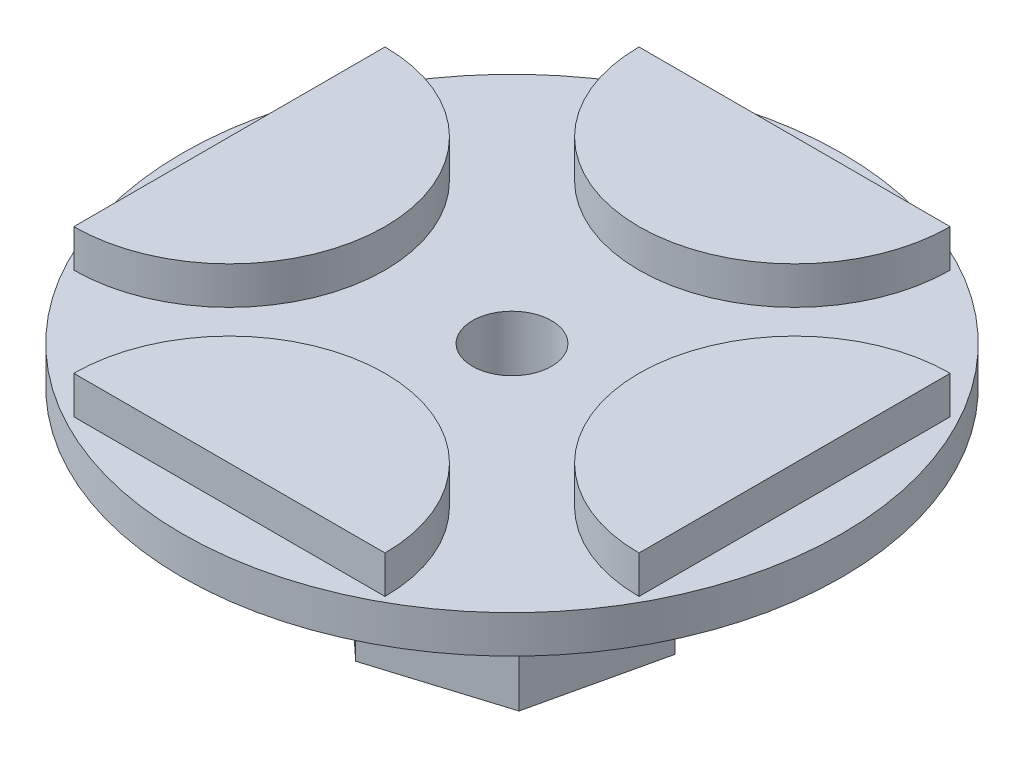
ISO-10303-21;
HEADER;
FILE_DESCRIPTION(('STEP AP214'),'2;1');
FILE_NAME('part.step','',(''),(''),'','','');
FILE_SCHEMA(('AUTOMOTIVE_DESIGN { 1 0 10303 214 1 1 1 1 }'));
ENDSEC;
DATA;
#1=APPLICATION_CONTEXT('core data for automotive mechanical design processes');
#2=APPLICATION_PROTOCOL_DEFINITION('international standard','automotive_design',2000,#1);
#3=PRODUCT_CONTEXT('',#1,'mechanical');
#4=PRODUCT('Part','Part','',(#3));
#5=PRODUCT_RELATED_PRODUCT_CATEGORY('part','',(#4));
#6=PRODUCT_DEFINITION_FORMATION('','',#4);
#7=PRODUCT_DEFINITION_CONTEXT('part definition',#1,'design');
#8=PRODUCT_DEFINITION('design','',#6,#7);
#9=PRODUCT_DEFINITION_SHAPE('','',#8);
#10=(LENGTH_UNIT() NAMED_UNIT(*) SI_UNIT(.MILLI.,.METRE.));
#11=(NAMED_UNIT(*) PLANE_ANGLE_UNIT() SI_UNIT($,.RADIAN.));
#12=(NAMED_UNIT(*) SI_UNIT($,.STERADIAN.) SOLID_ANGLE_UNIT());
#13=UNCERTAINTY_MEASURE_WITH_UNIT(LENGTH_MEASURE(1.E-05),#10,'distance_accuracy_value','');
#14=(GEOMETRIC_REPRESENTATION_CONTEXT(3) GLOBAL_UNCERTAINTY_ASSIGNED_CONTEXT((#13)) GLOBAL_UNIT_ASSIGNED_CONTEXT((#10,
#11,#12)) REPRESENTATION_CONTEXT('',''));
#15=CARTESIAN_POINT('',(0.,0.,0.));
#16=DIRECTION('',(0.,0.,1.));
#17=DIRECTION('',(1.,0.,0.));
#18=AXIS2_PLACEMENT_3D('',#15,#16,#17);
#19=CARTESIAN_POINT('',(0.,0.,0.));
#20=DIRECTION('',(0.,1.,0.));
#21=DIRECTION('',(0.,0.,1.));
#22=AXIS2_PLACEMENT_3D('',#19,#20,#21);
#23=PLANE('',#22);
#24=CARTESIAN_POINT('',(0.,0.,0.));
#25=DIRECTION('',(0.,1.,0.));
#26=DIRECTION('',(0.,0.,1.));
#27=AXIS2_PLACEMENT_3D('',#24,#25,#26);
#28=CIRCLE('',#27,17.5);
#29=CARTESIAN_POINT('',(0.,0.,17.5));
#30=VERTEX_POINT('',#29);
#31=EDGE_CURVE('E37',#30,#30,#28,.T.);
#32=ORIENTED_EDGE('',*,*,#31,.F.);
#33=EDGE_LOOP('',(#32));
#34=FACE_BOUND('',#33,.T.);
#35=DIRECTION('',(-0.733263391066099,0.,-0.679944703135663));
#36=VECTOR('',#35,1.);
#37=CARTESIAN_POINT('',(-1.53956932150052,0.,6.75497789073321));
#38=LINE('',#37,#36);
#39=CARTESIAN_POINT('',(-1.53956932150052,0.,6.75497789073321));
#40=VERTEX_POINT('',#39);
#41=CARTESIAN_POINT('',(-6.61976711612744,0.,2.04418280205998));
#42=VERTEX_POINT('',#41);
#43=EDGE_CURVE('E48',#40,#42,#38,.T.);
#44=ORIENTED_EDGE('',*,*,#43,.F.);
#45=DIRECTION('',(-0.955481081617202,0.,0.295052372760534));
#46=VECTOR('',#45,1.);
#47=CARTESIAN_POINT('',(5.08019779462692,0.,4.71079508867323));
#48=LINE('',#47,#46);
#49=CARTESIAN_POINT('',(5.08019779462692,0.,4.71079508867323));
#50=VERTEX_POINT('',#49);
#51=EDGE_CURVE('E52',#50,#40,#48,.T.);
#52=ORIENTED_EDGE('',*,*,#51,.F.);
#53=DIRECTION('',(-0.222217690551103,0.,0.974997075896197));
#54=VECTOR('',#53,1.);
#55=CARTESIAN_POINT('',(6.61976711612744,0.,-2.04418280205998));
#56=LINE('',#55,#54);
#57=CARTESIAN_POINT('',(6.61976711612744,0.,-2.04418280205998));
#58=VERTEX_POINT('',#57);
#59=EDGE_CURVE('E338',#58,#50,#56,.T.);
#60=ORIENTED_EDGE('',*,*,#59,.F.);
#61=DIRECTION('',(0.733263391066099,0.,0.679944703135663));
#62=VECTOR('',#61,1.);
#63=CARTESIAN_POINT('',(1.53956932150052,0.,-6.75497789073321));
#64=LINE('',#63,#62);
#65=CARTESIAN_POINT('',(1.53956932150052,0.,-6.75497789073321));
#66=VERTEX_POINT('',#65);
#67=EDGE_CURVE('E335',#66,#58,#64,.T.);
#68=ORIENTED_EDGE('',*,*,#67,.F.);
#69=DIRECTION('',(0.955481081617202,0.,-0.295052372760534));
#70=VECTOR('',#69,1.);
#71=CARTESIAN_POINT('',(-5.08019779462692,0.,-4.71079508867322));
#72=LINE('',#71,#70);
#73=CARTESIAN_POINT('',(-5.08019779462692,0.,-4.71079508867322));
#74=VERTEX_POINT('',#73);
#75=EDGE_CURVE('E332',#74,#66,#72,.T.);
#76=ORIENTED_EDGE('',*,*,#75,.F.);
#77=DIRECTION('',(0.222217690551103,0.,-0.974997075896197));
#78=VECTOR('',#77,1.);
#79=CARTESIAN_POINT('',(-6.61976711612744,0.,2.04418280205998));
#80=LINE('',#79,#78);
#81=EDGE_CURVE('E330',#42,#74,#80,.T.);
#82=ORIENTED_EDGE('',*,*,#81,.F.);
#83=EDGE_LOOP('',(#44,#52,#60,#68,#76,#82));
#84=FACE_BOUND('',#83,.T.);
#85=ADVANCED_FACE('F33',(#34,#84),#23,.F.);
#86=CARTESIAN_POINT('',(0.,2.,0.));
#87=DIRECTION('',(0.,1.,0.));
#88=DIRECTION('',(0.,0.,1.));
#89=AXIS2_PLACEMENT_3D('',#86,#87,#88);
#90=PLANE('',#89);
#91=CARTESIAN_POINT('',(0.,2.,0.));
#92=DIRECTION('',(0.,1.,0.));
#93=DIRECTION('',(0.,0.,1.));
#94=AXIS2_PLACEMENT_3D('',#91,#92,#93);
#95=CIRCLE('',#94,2.1);
#96=CARTESIAN_POINT('',(0.,2.,2.1));
#97=VERTEX_POINT('',#96);
#98=EDGE_CURVE('E315',#97,#97,#95,.T.);
#99=ORIENTED_EDGE('',*,*,#98,.F.);
#100=EDGE_LOOP('',(#99));
#101=FACE_BOUND('',#100,.T.);
#102=CARTESIAN_POINT('',(0.,2.,0.));
#103=DIRECTION('',(0.,1.,0.));
#104=DIRECTION('',(0.,0.,1.));
#105=AXIS2_PLACEMENT_3D('',#102,#103,#104);
#106=CIRCLE('',#105,17.5);
#107=CARTESIAN_POINT('',(0.,2.,17.5));
#108=VERTEX_POINT('',#107);
#109=EDGE_CURVE('E11',#108,#108,#106,.T.);
#110=ORIENTED_EDGE('',*,*,#109,.T.);
#111=EDGE_LOOP('',(#110));
#112=FACE_BOUND('',#111,.T.);
#113=DIRECTION('',(1.,0.,0.));
#114=VECTOR('',#113,1.);
#115=CARTESIAN_POINT('',(0.,2.,-15.));
#116=LINE('',#115,#114);
#117=CARTESIAN_POINT('',(-8.26,2.,-15.));
#118=VERTEX_POINT('',#117);
#119=CARTESIAN_POINT('',(8.26,2.,-15.));
#120=VERTEX_POINT('',#119);
#121=EDGE_CURVE('E217',#118,#120,#116,.T.);
#122=ORIENTED_EDGE('',*,*,#121,.T.);
#123=CARTESIAN_POINT('',(0.,2.,-15.));
#124=DIRECTION('',(0.,1.,0.));
#125=DIRECTION('',(0.,0.,1.));
#126=AXIS2_PLACEMENT_3D('',#123,#124,#125);
#127=CIRCLE('',#126,8.26);
#128=EDGE_CURVE('E220',#120,#118,#127,.F.);
#129=ORIENTED_EDGE('',*,*,#128,.T.);
#130=EDGE_LOOP('',(#122,#129));
#131=FACE_BOUND('',#130,.T.);
#132=DIRECTION('',(0.,0.,1.));
#133=VECTOR('',#132,1.);
#134=CARTESIAN_POINT('',(15.,2.,0.));
#135=LINE('',#134,#133);
#136=CARTESIAN_POINT('',(15.,2.,-8.25999999999995));
#137=VERTEX_POINT('',#136);
#138=CARTESIAN_POINT('',(15.,2.,8.26000000000005));
#139=VERTEX_POINT('',#138);
#140=EDGE_CURVE('E201',#137,#139,#135,.T.);
#141=ORIENTED_EDGE('',*,*,#140,.T.);
#142=CARTESIAN_POINT('',(15.,2.,0.));
#143=DIRECTION('',(0.,1.,0.));
#144=DIRECTION('',(0.,0.,1.));
#145=AXIS2_PLACEMENT_3D('',#142,#143,#144);
#146=CIRCLE('',#145,8.26);
#147=EDGE_CURVE('E204',#139,#137,#146,.F.);
#148=ORIENTED_EDGE('',*,*,#147,.T.);
#149=EDGE_LOOP('',(#141,#148));
#150=FACE_BOUND('',#149,.T.);
#151=DIRECTION('',(-1.,0.,0.));
#152=VECTOR('',#151,1.);
#153=CARTESIAN_POINT('',(-1.03957399589409E-13,2.,15.));
#154=LINE('',#153,#152);
#155=CARTESIAN_POINT('',(8.2599999999999,2.,15.0000000000001));
#156=VERTEX_POINT('',#155);
#157=CARTESIAN_POINT('',(-8.2600000000001,2.,14.9999999999999));
#158=VERTEX_POINT('',#157);
#159=EDGE_CURVE('E185',#156,#158,#154,.T.);
#160=ORIENTED_EDGE('',*,*,#159,.T.);
#161=CARTESIAN_POINT('',(-1.04744440165294E-13,2.,15.));
#162=DIRECTION('',(0.,1.,0.));
#163=DIRECTION('',(0.,0.,1.));
#164=AXIS2_PLACEMENT_3D('',#161,#162,#163);
#165=CIRCLE('',#164,8.26);
#166=EDGE_CURVE('E188',#158,#156,#165,.F.);
#167=ORIENTED_EDGE('',*,*,#166,.T.);
#168=EDGE_LOOP('',(#160,#167));
#169=FACE_BOUND('',#168,.T.);
#170=DIRECTION('',(0.,0.,-1.));
#171=VECTOR('',#170,1.);
#172=CARTESIAN_POINT('',(-15.,2.,-1.57511211499105E-13));
#173=LINE('',#172,#171);
#174=CARTESIAN_POINT('',(-15.0000000000001,2.,8.25999999999984));
#175=VERTEX_POINT('',#174);
#176=CARTESIAN_POINT('',(-14.9999999999999,2.,-8.26000000000016));
#177=VERTEX_POINT('',#176);
#178=EDGE_CURVE('E169',#175,#177,#173,.T.);
#179=ORIENTED_EDGE('',*,*,#178,.T.);
#180=CARTESIAN_POINT('',(-15.,2.,-1.57116660247941E-13));
#181=DIRECTION('',(0.,1.,0.));
#182=DIRECTION('',(0.,0.,1.));
#183=AXIS2_PLACEMENT_3D('',#180,#181,#182);
#184=CIRCLE('',#183,8.26);
#185=EDGE_CURVE('E172',#177,#175,#184,.F.);
#186=ORIENTED_EDGE('',*,*,#185,.T.);
#187=EDGE_LOOP('',(#179,#186));
#188=FACE_BOUND('',#187,.T.);
#189=ADVANCED_FACE('F229',(#101,#112,#131,#150,#169,#188),#90,.T.);
#190=CARTESIAN_POINT('',(0.,2.,0.));
#191=DIRECTION('',(0.,-1.,0.));
#192=DIRECTION('',(0.,0.,-1.));
#193=AXIS2_PLACEMENT_3D('',#190,#191,#192);
#194=CYLINDRICAL_SURFACE('',#193,17.5);
#195=ORIENTED_EDGE('',*,*,#109,.F.);
#196=EDGE_LOOP('',(#195));
#197=FACE_BOUND('',#196,.T.);
#198=ORIENTED_EDGE('',*,*,#31,.T.);
#199=EDGE_LOOP('',(#198));
#200=FACE_BOUND('',#199,.T.);
#201=ADVANCED_FACE('F35',(#197,#200),#194,.T.);
#202=CARTESIAN_POINT('',(0.,4.,-15.));
#203=DIRECTION('',(0.,-1.,0.));
#204=DIRECTION('',(0.,0.,-1.));
#205=AXIS2_PLACEMENT_3D('',#202,#203,#204);
#206=CYLINDRICAL_SURFACE('',#205,8.26);
#207=ORIENTED_EDGE('',*,*,#128,.F.);
#208=DIRECTION('',(0.,-1.,0.));
#209=VECTOR('',#208,1.);
#210=CARTESIAN_POINT('',(8.26,4.,-15.));
#211=LINE('',#210,#209);
#212=CARTESIAN_POINT('',(8.26,4.,-15.));
#213=VERTEX_POINT('',#212);
#214=EDGE_CURVE('E215',#213,#120,#211,.T.);
#215=ORIENTED_EDGE('',*,*,#214,.F.);
#216=CARTESIAN_POINT('',(0.,4.,-15.));
#217=DIRECTION('',(0.,1.,0.));
#218=DIRECTION('',(0.,0.,1.));
#219=AXIS2_PLACEMENT_3D('',#216,#217,#218);
#220=CIRCLE('',#219,8.26);
#221=CARTESIAN_POINT('',(-8.26,4.,-15.));
#222=VERTEX_POINT('',#221);
#223=EDGE_CURVE('E207',#222,#213,#220,.T.);
#224=ORIENTED_EDGE('',*,*,#223,.F.);
#225=DIRECTION('',(0.,-1.,0.));
#226=VECTOR('',#225,1.);
#227=CARTESIAN_POINT('',(-8.26,4.,-15.));
#228=LINE('',#227,#226);
#229=EDGE_CURVE('E212',#222,#118,#228,.T.);
#230=ORIENTED_EDGE('',*,*,#229,.T.);
#231=EDGE_LOOP('',(#207,#215,#224,#230));
#232=FACE_BOUND('',#231,.T.);
#233=ADVANCED_FACE('F236',(#232),#206,.T.);
#234=CARTESIAN_POINT('',(-8.26,4.,-15.));
#235=DIRECTION('',(0.,0.,1.));
#236=DIRECTION('',(1.,0.,0.));
#237=AXIS2_PLACEMENT_3D('',#234,#235,#236);
#238=PLANE('',#237);
#239=ORIENTED_EDGE('',*,*,#121,.F.);
#240=ORIENTED_EDGE('',*,*,#229,.F.);
#241=DIRECTION('',(-1.,0.,0.));
#242=VECTOR('',#241,1.);
#243=CARTESIAN_POINT('',(-8.26,4.,-15.));
#244=LINE('',#243,#242);
#245=EDGE_CURVE('E210',#213,#222,#244,.T.);
#246=ORIENTED_EDGE('',*,*,#245,.F.);
#247=ORIENTED_EDGE('',*,*,#214,.T.);
#248=EDGE_LOOP('',(#239,#240,#246,#247));
#249=FACE_BOUND('',#248,.T.);
#250=ADVANCED_FACE('F239',(#249),#238,.F.);
#251=CARTESIAN_POINT('',(0.,4.,-15.));
#252=DIRECTION('',(0.,1.,0.));
#253=DIRECTION('',(0.,0.,1.));
#254=AXIS2_PLACEMENT_3D('',#251,#252,#253);
#255=PLANE('',#254);
#256=ORIENTED_EDGE('',*,*,#223,.T.);
#257=ORIENTED_EDGE('',*,*,#245,.T.);
#258=EDGE_LOOP('',(#256,#257));
#259=FACE_BOUND('',#258,.T.);
#260=ADVANCED_FACE('F243',(#259),#255,.T.);
#261=CARTESIAN_POINT('',(15.,4.,0.));
#262=DIRECTION('',(0.,-1.,0.));
#263=DIRECTION('',(0.,0.,-1.));
#264=AXIS2_PLACEMENT_3D('',#261,#262,#263);
#265=CYLINDRICAL_SURFACE('',#264,8.26);
#266=ORIENTED_EDGE('',*,*,#147,.F.);
#267=DIRECTION('',(0.,-1.,0.));
#268=VECTOR('',#267,1.);
#269=CARTESIAN_POINT('',(15.,4.,8.26000000000005));
#270=LINE('',#269,#268);
#271=CARTESIAN_POINT('',(15.,4.,8.26000000000005));
#272=VERTEX_POINT('',#271);
#273=EDGE_CURVE('E199',#272,#139,#270,.T.);
#274=ORIENTED_EDGE('',*,*,#273,.F.);
#275=CARTESIAN_POINT('',(15.,4.,0.));
#276=DIRECTION('',(0.,1.,0.));
#277=DIRECTION('',(0.,0.,1.));
#278=AXIS2_PLACEMENT_3D('',#275,#276,#277);
#279=CIRCLE('',#278,8.26);
#280=CARTESIAN_POINT('',(15.,4.,-8.25999999999995));
#281=VERTEX_POINT('',#280);
#282=EDGE_CURVE('E191',#281,#272,#279,.T.);
#283=ORIENTED_EDGE('',*,*,#282,.F.);
#284=DIRECTION('',(0.,-1.,0.));
#285=VECTOR('',#284,1.);
#286=CARTESIAN_POINT('',(15.,4.,-8.25999999999995));
#287=LINE('',#286,#285);
#288=EDGE_CURVE('E196',#281,#137,#287,.T.);
#289=ORIENTED_EDGE('',*,*,#288,.T.);
#290=EDGE_LOOP('',(#266,#274,#283,#289));
#291=FACE_BOUND('',#290,.T.);
#292=ADVANCED_FACE('F247',(#291),#265,.T.);
#293=CARTESIAN_POINT('',(15.,4.,-8.25999999999995));
#294=DIRECTION('',(-1.,0.,0.));
#295=DIRECTION('',(0.,0.,1.));
#296=AXIS2_PLACEMENT_3D('',#293,#294,#295);
#297=PLANE('',#296);
#298=ORIENTED_EDGE('',*,*,#140,.F.);
#299=ORIENTED_EDGE('',*,*,#288,.F.);
#300=DIRECTION('',(0.,0.,-1.));
#301=VECTOR('',#300,1.);
#302=CARTESIAN_POINT('',(15.,4.,-8.25999999999995));
#303=LINE('',#302,#301);
#304=EDGE_CURVE('E194',#272,#281,#303,.T.);
#305=ORIENTED_EDGE('',*,*,#304,.F.);
#306=ORIENTED_EDGE('',*,*,#273,.T.);
#307=EDGE_LOOP('',(#298,#299,#305,#306));
#308=FACE_BOUND('',#307,.T.);
#309=ADVANCED_FACE('F251',(#308),#297,.F.);
#310=CARTESIAN_POINT('',(15.,4.,0.));
#311=DIRECTION('',(0.,1.,0.));
#312=DIRECTION('',(0.,0.,1.));
#313=AXIS2_PLACEMENT_3D('',#310,#311,#312);
#314=PLANE('',#313);
#315=ORIENTED_EDGE('',*,*,#282,.T.);
#316=ORIENTED_EDGE('',*,*,#304,.T.);
#317=EDGE_LOOP('',(#315,#316));
#318=FACE_BOUND('',#317,.T.);
#319=ADVANCED_FACE('F255',(#318),#314,.T.);
#320=CARTESIAN_POINT('',(-1.04744440165294E-13,4.,15.));
#321=DIRECTION('',(0.,-1.,0.));
#322=DIRECTION('',(0.,0.,-1.));
#323=AXIS2_PLACEMENT_3D('',#320,#321,#322);
#324=CYLINDRICAL_SURFACE('',#323,8.26);
#325=ORIENTED_EDGE('',*,*,#166,.F.);
#326=DIRECTION('',(0.,-1.,0.));
#327=VECTOR('',#326,1.);
#328=CARTESIAN_POINT('',(-8.2600000000001,4.,14.9999999999999));
#329=LINE('',#328,#327);
#330=CARTESIAN_POINT('',(-8.2600000000001,4.,14.9999999999999));
#331=VERTEX_POINT('',#330);
#332=EDGE_CURVE('E183',#331,#158,#329,.T.);
#333=ORIENTED_EDGE('',*,*,#332,.F.);
#334=CARTESIAN_POINT('',(-1.04744440165294E-13,4.,15.));
#335=DIRECTION('',(0.,1.,0.));
#336=DIRECTION('',(0.,0.,1.));
#337=AXIS2_PLACEMENT_3D('',#334,#335,#336);
#338=CIRCLE('',#337,8.26);
#339=CARTESIAN_POINT('',(8.2599999999999,4.,15.0000000000001));
#340=VERTEX_POINT('',#339);
#341=EDGE_CURVE('E175',#340,#331,#338,.T.);
#342=ORIENTED_EDGE('',*,*,#341,.F.);
#343=DIRECTION('',(0.,-1.,0.));
#344=VECTOR('',#343,1.);
#345=CARTESIAN_POINT('',(8.2599999999999,4.,15.0000000000001));
#346=LINE('',#345,#344);
#347=EDGE_CURVE('E180',#340,#156,#346,.T.);
#348=ORIENTED_EDGE('',*,*,#347,.T.);
#349=EDGE_LOOP('',(#325,#333,#342,#348));
#350=FACE_BOUND('',#349,.T.);
#351=ADVANCED_FACE('F259',(#350),#324,.T.);
#352=CARTESIAN_POINT('',(8.2599999999999,4.,15.0000000000001));
#353=DIRECTION('',(0.,0.,-1.));
#354=DIRECTION('',(-1.,0.,0.));
#355=AXIS2_PLACEMENT_3D('',#352,#353,#354);
#356=PLANE('',#355);
#357=ORIENTED_EDGE('',*,*,#159,.F.);
#358=ORIENTED_EDGE('',*,*,#347,.F.);
#359=DIRECTION('',(1.,0.,0.));
#360=VECTOR('',#359,1.);
#361=CARTESIAN_POINT('',(8.2599999999999,4.,15.0000000000001));
#362=LINE('',#361,#360);
#363=EDGE_CURVE('E178',#331,#340,#362,.T.);
#364=ORIENTED_EDGE('',*,*,#363,.F.);
#365=ORIENTED_EDGE('',*,*,#332,.T.);
#366=EDGE_LOOP('',(#357,#358,#364,#365));
#367=FACE_BOUND('',#366,.T.);
#368=ADVANCED_FACE('F263',(#367),#356,.F.);
#369=CARTESIAN_POINT('',(-1.04744440165294E-13,4.,15.));
#370=DIRECTION('',(0.,1.,0.));
#371=DIRECTION('',(0.,0.,1.));
#372=AXIS2_PLACEMENT_3D('',#369,#370,#371);
#373=PLANE('',#372);
#374=ORIENTED_EDGE('',*,*,#341,.T.);
#375=ORIENTED_EDGE('',*,*,#363,.T.);
#376=EDGE_LOOP('',(#374,#375));
#377=FACE_BOUND('',#376,.T.);
#378=ADVANCED_FACE('F267',(#377),#373,.T.);
#379=CARTESIAN_POINT('',(-15.,4.,-1.57116660247941E-13));
#380=DIRECTION('',(0.,-1.,0.));
#381=DIRECTION('',(0.,0.,-1.));
#382=AXIS2_PLACEMENT_3D('',#379,#380,#381);
#383=CYLINDRICAL_SURFACE('',#382,8.26);
#384=ORIENTED_EDGE('',*,*,#185,.F.);
#385=DIRECTION('',(0.,-1.,0.));
#386=VECTOR('',#385,1.);
#387=CARTESIAN_POINT('',(-14.9999999999999,4.,-8.26000000000016));
#388=LINE('',#387,#386);
#389=CARTESIAN_POINT('',(-14.9999999999999,4.,-8.26000000000016));
#390=VERTEX_POINT('',#389);
#391=EDGE_CURVE('E167',#390,#177,#388,.T.);
#392=ORIENTED_EDGE('',*,*,#391,.F.);
#393=CARTESIAN_POINT('',(-15.,4.,-1.57116660247941E-13));
#394=DIRECTION('',(0.,1.,0.));
#395=DIRECTION('',(0.,0.,1.));
#396=AXIS2_PLACEMENT_3D('',#393,#394,#395);
#397=CIRCLE('',#396,8.26);
#398=CARTESIAN_POINT('',(-15.0000000000001,4.,8.25999999999984));
#399=VERTEX_POINT('',#398);
#400=EDGE_CURVE('E154',#399,#390,#397,.T.);
#401=ORIENTED_EDGE('',*,*,#400,.F.);
#402=DIRECTION('',(0.,-1.,0.));
#403=VECTOR('',#402,1.);
#404=CARTESIAN_POINT('',(-15.0000000000001,4.,8.25999999999984));
#405=LINE('',#404,#403);
#406=EDGE_CURVE('E164',#399,#175,#405,.T.);
#407=ORIENTED_EDGE('',*,*,#406,.T.);
#408=EDGE_LOOP('',(#384,#392,#401,#407));
#409=FACE_BOUND('',#408,.T.);
#410=ADVANCED_FACE('F271',(#409),#383,.T.);
#411=CARTESIAN_POINT('',(-15.0000000000001,4.,8.25999999999984));
#412=DIRECTION('',(1.,0.,0.));
#413=DIRECTION('',(0.,0.,-1.));
#414=AXIS2_PLACEMENT_3D('',#411,#412,#413);
#415=PLANE('',#414);
#416=ORIENTED_EDGE('',*,*,#178,.F.);
#417=ORIENTED_EDGE('',*,*,#406,.F.);
#418=DIRECTION('',(0.,0.,1.));
#419=VECTOR('',#418,1.);
#420=CARTESIAN_POINT('',(-15.0000000000001,4.,8.25999999999984));
#421=LINE('',#420,#419);
#422=EDGE_CURVE('E157',#390,#399,#421,.T.);
#423=ORIENTED_EDGE('',*,*,#422,.F.);
#424=ORIENTED_EDGE('',*,*,#391,.T.);
#425=EDGE_LOOP('',(#416,#417,#423,#424));
#426=FACE_BOUND('',#425,.T.);
#427=ADVANCED_FACE('F275',(#426),#415,.F.);
#428=CARTESIAN_POINT('',(-15.,4.,-1.57116660247941E-13));
#429=DIRECTION('',(0.,1.,0.));
#430=DIRECTION('',(0.,0.,1.));
#431=AXIS2_PLACEMENT_3D('',#428,#429,#430);
#432=PLANE('',#431);
#433=ORIENTED_EDGE('',*,*,#400,.T.);
#434=ORIENTED_EDGE('',*,*,#422,.T.);
#435=EDGE_LOOP('',(#433,#434));
#436=FACE_BOUND('',#435,.T.);
#437=ADVANCED_FACE('F279',(#436),#432,.T.);
#438=CARTESIAN_POINT('',(-1.53956932150052,-10.,6.75497789073321));
#439=DIRECTION('',(0.679944703135663,0.,-0.733263391066099));
#440=DIRECTION('',(-0.733263391066099,0.,-0.679944703135663));
#441=AXIS2_PLACEMENT_3D('',#438,#439,#440);
#442=PLANE('',#441);
#443=ORIENTED_EDGE('',*,*,#43,.T.);
#444=DIRECTION('',(0.,1.,0.));
#445=VECTOR('',#444,1.);
#446=CARTESIAN_POINT('',(-6.61976711612744,-10.,2.04418280205998));
#447=LINE('',#446,#445);
#448=CARTESIAN_POINT('',(-6.61976711612744,-10.,2.04418280205998));
#449=VERTEX_POINT('',#448);
#450=EDGE_CURVE('E137',#449,#42,#447,.T.);
#451=ORIENTED_EDGE('',*,*,#450,.F.);
#452=DIRECTION('',(-0.733263391066099,0.,-0.679944703135663));
#453=VECTOR('',#452,1.);
#454=CARTESIAN_POINT('',(-1.53956932150052,-10.,6.75497789073321));
#455=LINE('',#454,#453);
#456=CARTESIAN_POINT('',(-1.53956932150052,-10.,6.75497789073321));
#457=VERTEX_POINT('',#456);
#458=EDGE_CURVE('E143',#457,#449,#455,.T.);
#459=ORIENTED_EDGE('',*,*,#458,.F.);
#460=DIRECTION('',(0.,1.,0.));
#461=VECTOR('',#460,1.);
#462=CARTESIAN_POINT('',(-1.53956932150052,-10.,6.75497789073321));
#463=LINE('',#462,#461);
#464=EDGE_CURVE('E328',#457,#40,#463,.T.);
#465=ORIENTED_EDGE('',*,*,#464,.T.);
#466=EDGE_LOOP('',(#443,#451,#459,#465));
#467=FACE_BOUND('',#466,.T.);
#468=ADVANCED_FACE('F153',(#467),#442,.F.);
#469=CARTESIAN_POINT('',(-6.61976711612744,-10.,2.04418280205998));
#470=DIRECTION('',(0.974997075896197,0.,0.222217690551103));
#471=DIRECTION('',(0.222217690551103,0.,-0.974997075896197));
#472=AXIS2_PLACEMENT_3D('',#469,#470,#471);
#473=PLANE('',#472);
#474=ORIENTED_EDGE('',*,*,#81,.T.);
#475=DIRECTION('',(0.,1.,0.));
#476=VECTOR('',#475,1.);
#477=CARTESIAN_POINT('',(-5.08019779462692,-10.,-4.71079508867322));
#478=LINE('',#477,#476);
#479=CARTESIAN_POINT('',(-5.08019779462692,-10.,-4.71079508867322));
#480=VERTEX_POINT('',#479);
#481=EDGE_CURVE('E139',#480,#74,#478,.T.);
#482=ORIENTED_EDGE('',*,*,#481,.F.);
#483=DIRECTION('',(0.222217690551103,0.,-0.974997075896197));
#484=VECTOR('',#483,1.);
#485=CARTESIAN_POINT('',(-6.61976711612744,-10.,2.04418280205998));
#486=LINE('',#485,#484);
#487=EDGE_CURVE('E132',#449,#480,#486,.T.);
#488=ORIENTED_EDGE('',*,*,#487,.F.);
#489=ORIENTED_EDGE('',*,*,#450,.T.);
#490=EDGE_LOOP('',(#474,#482,#488,#489));
#491=FACE_BOUND('',#490,.T.);
#492=ADVANCED_FACE('F135',(#491),#473,.F.);
#493=CARTESIAN_POINT('',(-5.08019779462692,-10.,-4.71079508867322));
#494=DIRECTION('',(0.295052372760534,0.,0.955481081617202));
#495=DIRECTION('',(0.955481081617202,0.,-0.295052372760534));
#496=AXIS2_PLACEMENT_3D('',#493,#494,#495);
#497=PLANE('',#496);
#498=ORIENTED_EDGE('',*,*,#75,.T.);
#499=DIRECTION('',(0.,1.,0.));
#500=VECTOR('',#499,1.);
#501=CARTESIAN_POINT('',(1.53956932150052,-10.,-6.75497789073321));
#502=LINE('',#501,#500);
#503=CARTESIAN_POINT('',(1.53956932150052,-10.,-6.75497789073321));
#504=VERTEX_POINT('',#503);
#505=EDGE_CURVE('E159',#504,#66,#502,.T.);
#506=ORIENTED_EDGE('',*,*,#505,.F.);
#507=DIRECTION('',(0.955481081617202,0.,-0.295052372760534));
#508=VECTOR('',#507,1.);
#509=CARTESIAN_POINT('',(-5.08019779462692,-10.,-4.71079508867322));
#510=LINE('',#509,#508);
#511=EDGE_CURVE('E142',#480,#504,#510,.T.);
#512=ORIENTED_EDGE('',*,*,#511,.F.);
#513=ORIENTED_EDGE('',*,*,#481,.T.);
#514=EDGE_LOOP('',(#498,#506,#512,#513));
#515=FACE_BOUND('',#514,.T.);
#516=ADVANCED_FACE('F288',(#515),#497,.F.);
#517=CARTESIAN_POINT('',(1.53956932150052,-10.,-6.75497789073321));
#518=DIRECTION('',(-0.679944703135663,0.,0.733263391066099));
#519=DIRECTION('',(0.733263391066099,0.,0.679944703135663));
#520=AXIS2_PLACEMENT_3D('',#517,#518,#519);
#521=PLANE('',#520);
#522=ORIENTED_EDGE('',*,*,#67,.T.);
#523=DIRECTION('',(0.,1.,0.));
#524=VECTOR('',#523,1.);
#525=CARTESIAN_POINT('',(6.61976711612744,-10.,-2.04418280205998));
#526=LINE('',#525,#524);
#527=CARTESIAN_POINT('',(6.61976711612744,-10.,-2.04418280205998));
#528=VERTEX_POINT('',#527);
#529=EDGE_CURVE('E345',#528,#58,#526,.T.);
#530=ORIENTED_EDGE('',*,*,#529,.F.);
#531=DIRECTION('',(0.733263391066099,0.,0.679944703135663));
#532=VECTOR('',#531,1.);
#533=CARTESIAN_POINT('',(1.53956932150052,-10.,-6.75497789073321));
#534=LINE('',#533,#532);
#535=EDGE_CURVE('E323',#504,#528,#534,.T.);
#536=ORIENTED_EDGE('',*,*,#535,.F.);
#537=ORIENTED_EDGE('',*,*,#505,.T.);
#538=EDGE_LOOP('',(#522,#530,#536,#537));
#539=FACE_BOUND('',#538,.T.);
#540=ADVANCED_FACE('F291',(#539),#521,.F.);
#541=CARTESIAN_POINT('',(6.61976711612744,-10.,-2.04418280205998));
#542=DIRECTION('',(-0.974997075896197,0.,-0.222217690551103));
#543=DIRECTION('',(-0.222217690551103,0.,0.974997075896197));
#544=AXIS2_PLACEMENT_3D('',#541,#542,#543);
#545=PLANE('',#544);
#546=ORIENTED_EDGE('',*,*,#59,.T.);
#547=DIRECTION('',(0.,1.,0.));
#548=VECTOR('',#547,1.);
#549=CARTESIAN_POINT('',(5.08019779462692,-10.,4.71079508867323));
#550=LINE('',#549,#548);
#551=CARTESIAN_POINT('',(5.08019779462692,-10.,4.71079508867323));
#552=VERTEX_POINT('',#551);
#553=EDGE_CURVE('E342',#552,#50,#550,.T.);
#554=ORIENTED_EDGE('',*,*,#553,.F.);
#555=DIRECTION('',(-0.222217690551103,0.,0.974997075896197));
#556=VECTOR('',#555,1.);
#557=CARTESIAN_POINT('',(6.61976711612744,-10.,-2.04418280205998));
#558=LINE('',#557,#556);
#559=EDGE_CURVE('E325',#528,#552,#558,.T.);
#560=ORIENTED_EDGE('',*,*,#559,.F.);
#561=ORIENTED_EDGE('',*,*,#529,.T.);
#562=EDGE_LOOP('',(#546,#554,#560,#561));
#563=FACE_BOUND('',#562,.T.);
#564=ADVANCED_FACE('F295',(#563),#545,.F.);
#565=CARTESIAN_POINT('',(5.08019779462692,-10.,4.71079508867323));
#566=DIRECTION('',(-0.295052372760534,0.,-0.955481081617202));
#567=DIRECTION('',(-0.955481081617202,0.,0.295052372760534));
#568=AXIS2_PLACEMENT_3D('',#565,#566,#567);
#569=PLANE('',#568);
#570=ORIENTED_EDGE('',*,*,#51,.T.);
#571=ORIENTED_EDGE('',*,*,#464,.F.);
#572=DIRECTION('',(-0.955481081617202,0.,0.295052372760534));
#573=VECTOR('',#572,1.);
#574=CARTESIAN_POINT('',(5.08019779462692,-10.,4.71079508867323));
#575=LINE('',#574,#573);
#576=EDGE_CURVE('E148',#552,#457,#575,.T.);
#577=ORIENTED_EDGE('',*,*,#576,.F.);
#578=ORIENTED_EDGE('',*,*,#553,.T.);
#579=EDGE_LOOP('',(#570,#571,#577,#578));
#580=FACE_BOUND('',#579,.T.);
#581=ADVANCED_FACE('F299',(#580),#569,.F.);
#582=CARTESIAN_POINT('',(0.,-10.,0.));
#583=DIRECTION('',(0.,-1.,0.));
#584=DIRECTION('',(0.,0.,-1.));
#585=AXIS2_PLACEMENT_3D('',#582,#583,#584);
#586=PLANE('',#585);
#587=CARTESIAN_POINT('',(0.,-10.,0.));
#588=DIRECTION('',(0.,1.,0.));
#589=DIRECTION('',(0.,0.,1.));
#590=AXIS2_PLACEMENT_3D('',#587,#588,#589);
#591=CIRCLE('',#590,2.1);
#592=CARTESIAN_POINT('',(0.,-10.,2.1));
#593=VERTEX_POINT('',#592);
#594=EDGE_CURVE('E318',#593,#593,#591,.T.);
#595=ORIENTED_EDGE('',*,*,#594,.T.);
#596=EDGE_LOOP('',(#595));
#597=FACE_BOUND('',#596,.T.);
#598=ORIENTED_EDGE('',*,*,#458,.T.);
#599=ORIENTED_EDGE('',*,*,#487,.T.);
#600=ORIENTED_EDGE('',*,*,#511,.T.);
#601=ORIENTED_EDGE('',*,*,#535,.T.);
#602=ORIENTED_EDGE('',*,*,#559,.T.);
#603=ORIENTED_EDGE('',*,*,#576,.T.);
#604=EDGE_LOOP('',(#598,#599,#600,#601,#602,#603));
#605=FACE_BOUND('',#604,.T.);
#606=ADVANCED_FACE('F146',(#597,#605),#586,.T.);
#607=CARTESIAN_POINT('',(0.,-10.,0.));
#608=DIRECTION('',(0.,1.,0.));
#609=DIRECTION('',(0.,0.,1.));
#610=AXIS2_PLACEMENT_3D('',#607,#608,#609);
#611=CYLINDRICAL_SURFACE('',#610,2.1);
#612=ORIENTED_EDGE('',*,*,#98,.T.);
#613=EDGE_LOOP('',(#612));
#614=FACE_BOUND('',#613,.T.);
#615=ORIENTED_EDGE('',*,*,#594,.F.);
#616=EDGE_LOOP('',(#615));
#617=FACE_BOUND('',#616,.T.);
#618=ADVANCED_FACE('F306',(#614,#617),#611,.F.);
#619=CLOSED_SHELL('',(#85,#189,#201,#233,#250,#260,#292,#309,#319,#351,#368,#378,#410,#427,#437,
#468,#492,#516,#540,#564,#581,#606,#618));
#620=MANIFOLD_SOLID_BREP('B2',#619);
#621=ADVANCED_BREP_SHAPE_REPRESENTATION('',(#18,#620),#14);
#622=SHAPE_DEFINITION_REPRESENTATION(#9,#621);
ENDSEC;
END-ISO-10303-21;
